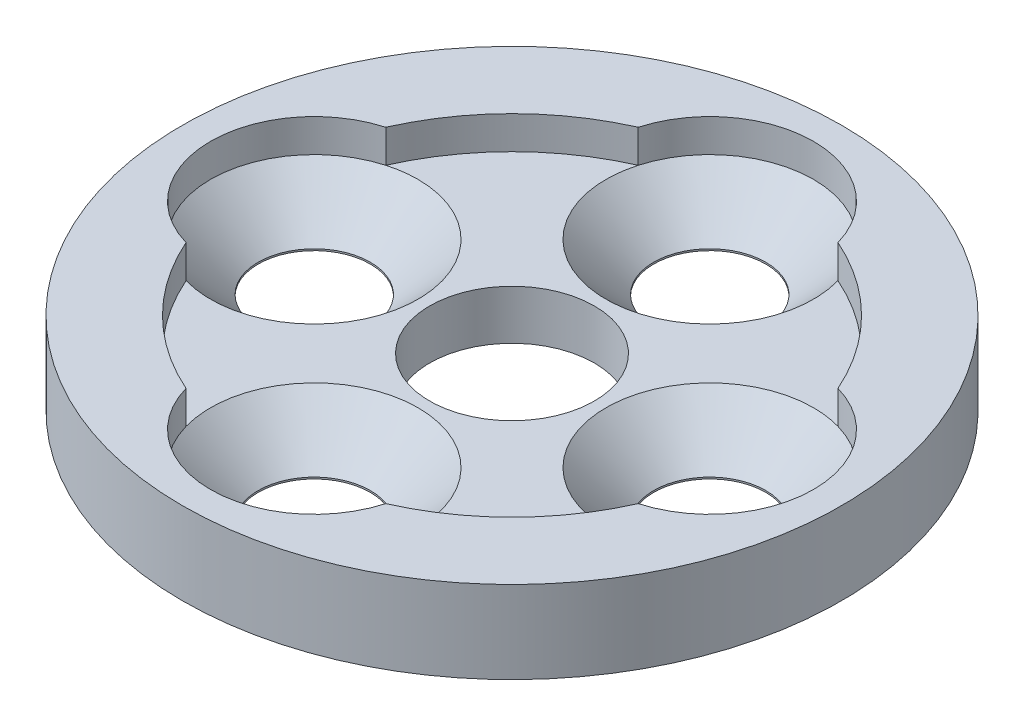
ISO-10303-21;
HEADER;
FILE_DESCRIPTION(('STEP AP214'),'2;1');
FILE_NAME('part.step','',(''),(''),'','','');
FILE_SCHEMA(('AUTOMOTIVE_DESIGN { 1 0 10303 214 1 1 1 1 }'));
ENDSEC;
DATA;
#1=APPLICATION_CONTEXT('core data for automotive mechanical design processes');
#2=APPLICATION_PROTOCOL_DEFINITION('international standard','automotive_design',2000,#1);
#3=PRODUCT_CONTEXT('',#1,'mechanical');
#4=PRODUCT('Part','Part','',(#3));
#5=PRODUCT_RELATED_PRODUCT_CATEGORY('part','',(#4));
#6=PRODUCT_DEFINITION_FORMATION('','',#4);
#7=PRODUCT_DEFINITION_CONTEXT('part definition',#1,'design');
#8=PRODUCT_DEFINITION('design','',#6,#7);
#9=PRODUCT_DEFINITION_SHAPE('','',#8);
#10=(LENGTH_UNIT() NAMED_UNIT(*) SI_UNIT(.MILLI.,.METRE.));
#11=(NAMED_UNIT(*) PLANE_ANGLE_UNIT() SI_UNIT($,.RADIAN.));
#12=(NAMED_UNIT(*) SI_UNIT($,.STERADIAN.) SOLID_ANGLE_UNIT());
#13=UNCERTAINTY_MEASURE_WITH_UNIT(LENGTH_MEASURE(1.E-05),#10,'distance_accuracy_value','');
#14=(GEOMETRIC_REPRESENTATION_CONTEXT(3) GLOBAL_UNCERTAINTY_ASSIGNED_CONTEXT((#13)) GLOBAL_UNIT_ASSIGNED_CONTEXT((#10,
#11,#12)) REPRESENTATION_CONTEXT('',''));
#15=CARTESIAN_POINT('',(0.,0.,0.));
#16=DIRECTION('',(0.,0.,1.));
#17=DIRECTION('',(1.,0.,0.));
#18=AXIS2_PLACEMENT_3D('',#15,#16,#17);
#19=CARTESIAN_POINT('',(0.,2.5,0.));
#20=DIRECTION('',(0.,-1.,0.));
#21=DIRECTION('',(0.,0.,1.));
#22=AXIS2_PLACEMENT_3D('',#19,#20,#21);
#23=CYLINDRICAL_SURFACE('',#22,7.5);
#24=CARTESIAN_POINT('',(0.,2.5,0.));
#25=DIRECTION('',(0.,-1.,0.));
#26=DIRECTION('',(0.,0.,-1.));
#27=AXIS2_PLACEMENT_3D('',#24,#25,#26);
#28=CIRCLE('',#27,7.5);
#29=CARTESIAN_POINT('',(-3.03015257196317,2.5,6.860625));
#30=VERTEX_POINT('',#29);
#31=CARTESIAN_POINT('',(-6.860625,2.5,3.03015257196317));
#32=VERTEX_POINT('',#31);
#33=EDGE_CURVE('E245',#30,#32,#28,.T.);
#34=ORIENTED_EDGE('',*,*,#33,.F.);
#35=DIRECTION('',(0.,-1.,0.));
#36=VECTOR('',#35,1.);
#37=CARTESIAN_POINT('',(-3.03015257196317,12.,6.860625));
#38=LINE('',#37,#36);
#39=CARTESIAN_POINT('',(-3.03015257196317,1.5,6.860625));
#40=VERTEX_POINT('',#39);
#41=EDGE_CURVE('E133',#40,#30,#38,.F.);
#42=ORIENTED_EDGE('',*,*,#41,.F.);
#43=CARTESIAN_POINT('',(0.,1.5,0.));
#44=DIRECTION('',(0.,-1.,0.));
#45=DIRECTION('',(0.,0.,-1.));
#46=AXIS2_PLACEMENT_3D('',#43,#44,#45);
#47=CIRCLE('',#46,7.5);
#48=CARTESIAN_POINT('',(-6.860625,1.5,3.03015257196317));
#49=VERTEX_POINT('',#48);
#50=EDGE_CURVE('E48',#49,#40,#47,.F.);
#51=ORIENTED_EDGE('',*,*,#50,.F.);
#52=DIRECTION('',(0.,-1.,0.));
#53=VECTOR('',#52,1.);
#54=CARTESIAN_POINT('',(-6.860625,12.,3.03015257196317));
#55=LINE('',#54,#53);
#56=EDGE_CURVE('E127',#32,#49,#55,.T.);
#57=ORIENTED_EDGE('',*,*,#56,.F.);
#58=EDGE_LOOP('',(#34,#42,#51,#57));
#59=FACE_BOUND('',#58,.T.);
#60=ADVANCED_FACE('F39',(#59),#23,.F.);
#61=CARTESIAN_POINT('',(-3.03015257196317,1.5,-6.860625));
#62=VERTEX_POINT('',#61);
#63=CARTESIAN_POINT('',(-6.860625,1.5,-3.03015257196317));
#64=VERTEX_POINT('',#63);
#65=EDGE_CURVE('E11',#62,#64,#47,.F.);
#66=ORIENTED_EDGE('',*,*,#65,.F.);
#67=DIRECTION('',(0.,-1.,0.));
#68=VECTOR('',#67,1.);
#69=CARTESIAN_POINT('',(-3.03015257196317,12.,-6.860625));
#70=LINE('',#69,#68);
#71=CARTESIAN_POINT('',(-3.03015257196317,2.5,-6.860625));
#72=VERTEX_POINT('',#71);
#73=EDGE_CURVE('E125',#72,#62,#70,.T.);
#74=ORIENTED_EDGE('',*,*,#73,.F.);
#75=CARTESIAN_POINT('',(-6.860625,2.5,-3.03015257196317));
#76=VERTEX_POINT('',#75);
#77=EDGE_CURVE('E148',#76,#72,#28,.T.);
#78=ORIENTED_EDGE('',*,*,#77,.F.);
#79=DIRECTION('',(0.,-1.,0.));
#80=VECTOR('',#79,1.);
#81=CARTESIAN_POINT('',(-6.860625,12.,-3.03015257196317));
#82=LINE('',#81,#80);
#83=EDGE_CURVE('E198',#64,#76,#82,.F.);
#84=ORIENTED_EDGE('',*,*,#83,.F.);
#85=EDGE_LOOP('',(#66,#74,#78,#84));
#86=FACE_BOUND('',#85,.T.);
#87=ADVANCED_FACE('F220',(#86),#23,.F.);
#88=CARTESIAN_POINT('',(6.860625,1.5,-3.03015257196317));
#89=VERTEX_POINT('',#88);
#90=CARTESIAN_POINT('',(3.03015257196317,1.5,-6.860625));
#91=VERTEX_POINT('',#90);
#92=EDGE_CURVE('E49',#89,#91,#47,.F.);
#93=ORIENTED_EDGE('',*,*,#92,.F.);
#94=DIRECTION('',(0.,-1.,0.));
#95=VECTOR('',#94,1.);
#96=CARTESIAN_POINT('',(6.860625,12.,-3.03015257196317));
#97=LINE('',#96,#95);
#98=CARTESIAN_POINT('',(6.860625,2.5,-3.03015257196317));
#99=VERTEX_POINT('',#98);
#100=EDGE_CURVE('E186',#99,#89,#97,.T.);
#101=ORIENTED_EDGE('',*,*,#100,.F.);
#102=CARTESIAN_POINT('',(3.03015257196317,2.5,-6.860625));
#103=VERTEX_POINT('',#102);
#104=EDGE_CURVE('E144',#103,#99,#28,.T.);
#105=ORIENTED_EDGE('',*,*,#104,.F.);
#106=DIRECTION('',(0.,-1.,0.));
#107=VECTOR('',#106,1.);
#108=CARTESIAN_POINT('',(3.03015257196317,12.,-6.860625));
#109=LINE('',#108,#107);
#110=EDGE_CURVE('E183',#91,#103,#109,.F.);
#111=ORIENTED_EDGE('',*,*,#110,.F.);
#112=EDGE_LOOP('',(#93,#101,#105,#111));
#113=FACE_BOUND('',#112,.T.);
#114=ADVANCED_FACE('F226',(#113),#23,.F.);
#115=CARTESIAN_POINT('',(6.860625,2.5,3.03015257196317));
#116=VERTEX_POINT('',#115);
#117=CARTESIAN_POINT('',(3.03015257196317,2.5,6.860625));
#118=VERTEX_POINT('',#117);
#119=EDGE_CURVE('E147',#116,#118,#28,.T.);
#120=ORIENTED_EDGE('',*,*,#119,.F.);
#121=DIRECTION('',(0.,-1.,0.));
#122=VECTOR('',#121,1.);
#123=CARTESIAN_POINT('',(6.860625,12.,3.03015257196317));
#124=LINE('',#123,#122);
#125=CARTESIAN_POINT('',(6.860625,1.5,3.03015257196317));
#126=VERTEX_POINT('',#125);
#127=EDGE_CURVE('E190',#126,#116,#124,.F.);
#128=ORIENTED_EDGE('',*,*,#127,.F.);
#129=CARTESIAN_POINT('',(3.03015257196317,1.5,6.860625));
#130=VERTEX_POINT('',#129);
#131=EDGE_CURVE('E135',#130,#126,#47,.F.);
#132=ORIENTED_EDGE('',*,*,#131,.F.);
#133=DIRECTION('',(0.,-1.,0.));
#134=VECTOR('',#133,1.);
#135=CARTESIAN_POINT('',(3.03015257196317,12.,6.860625));
#136=LINE('',#135,#134);
#137=EDGE_CURVE('E192',#118,#130,#136,.T.);
#138=ORIENTED_EDGE('',*,*,#137,.F.);
#139=EDGE_LOOP('',(#120,#128,#132,#138));
#140=FACE_BOUND('',#139,.T.);
#141=ADVANCED_FACE('F222',(#140),#23,.F.);
#142=CARTESIAN_POINT('',(0.,1.5,0.));
#143=DIRECTION('',(0.,-1.,0.));
#144=DIRECTION('',(0.,0.,1.));
#145=AXIS2_PLACEMENT_3D('',#142,#143,#144);
#146=CYLINDRICAL_SURFACE('',#145,10.);
#147=CARTESIAN_POINT('',(0.,0.,0.));
#148=DIRECTION('',(0.,-1.,0.));
#149=DIRECTION('',(0.,0.,-1.));
#150=AXIS2_PLACEMENT_3D('',#147,#148,#149);
#151=CIRCLE('',#150,10.);
#152=CARTESIAN_POINT('',(0.,0.,-10.));
#153=VERTEX_POINT('',#152);
#154=EDGE_CURVE('E138',#153,#153,#151,.T.);
#155=ORIENTED_EDGE('',*,*,#154,.F.);
#156=EDGE_LOOP('',(#155));
#157=FACE_BOUND('',#156,.T.);
#158=CARTESIAN_POINT('',(0.,2.5,0.));
#159=DIRECTION('',(0.,-1.,0.));
#160=DIRECTION('',(0.,0.,-1.));
#161=AXIS2_PLACEMENT_3D('',#158,#159,#160);
#162=CIRCLE('',#161,10.);
#163=CARTESIAN_POINT('',(0.,2.5,-10.));
#164=VERTEX_POINT('',#163);
#165=EDGE_CURVE('E141',#164,#164,#162,.T.);
#166=ORIENTED_EDGE('',*,*,#165,.T.);
#167=EDGE_LOOP('',(#166));
#168=FACE_BOUND('',#167,.T.);
#169=ADVANCED_FACE('F41',(#157,#168),#146,.T.);
#170=CARTESIAN_POINT('',(0.,0.,0.));
#171=DIRECTION('',(0.,1.,0.));
#172=DIRECTION('',(0.,0.,-1.));
#173=AXIS2_PLACEMENT_3D('',#170,#171,#172);
#174=PLANE('',#173);
#175=CARTESIAN_POINT('',(0.,0.,0.));
#176=DIRECTION('',(0.,-1.,0.));
#177=DIRECTION('',(0.,0.,-1.));
#178=AXIS2_PLACEMENT_3D('',#175,#176,#177);
#179=CIRCLE('',#178,2.5);
#180=CARTESIAN_POINT('',(0.,0.,-2.5));
#181=VERTEX_POINT('',#180);
#182=EDGE_CURVE('E200',#181,#181,#179,.T.);
#183=ORIENTED_EDGE('',*,*,#182,.F.);
#184=EDGE_LOOP('',(#183));
#185=FACE_BOUND('',#184,.T.);
#186=CARTESIAN_POINT('',(-6.,0.,0.));
#187=DIRECTION('',(0.,-1.,0.));
#188=DIRECTION('',(0.,0.,-1.));
#189=AXIS2_PLACEMENT_3D('',#186,#187,#188);
#190=CIRCLE('',#189,1.7);
#191=CARTESIAN_POINT('',(-6.,0.,-1.7));
#192=VERTEX_POINT('',#191);
#193=EDGE_CURVE('E174',#192,#192,#190,.T.);
#194=ORIENTED_EDGE('',*,*,#193,.F.);
#195=EDGE_LOOP('',(#194));
#196=FACE_BOUND('',#195,.T.);
#197=CARTESIAN_POINT('',(0.,0.,6.));
#198=DIRECTION('',(0.,-1.,0.));
#199=DIRECTION('',(0.,0.,-1.));
#200=AXIS2_PLACEMENT_3D('',#197,#198,#199);
#201=CIRCLE('',#200,1.7);
#202=CARTESIAN_POINT('',(0.,0.,4.3));
#203=VERTEX_POINT('',#202);
#204=EDGE_CURVE('E166',#203,#203,#201,.T.);
#205=ORIENTED_EDGE('',*,*,#204,.F.);
#206=EDGE_LOOP('',(#205));
#207=FACE_BOUND('',#206,.T.);
#208=CARTESIAN_POINT('',(6.,0.,0.));
#209=DIRECTION('',(0.,-1.,0.));
#210=DIRECTION('',(0.,0.,-1.));
#211=AXIS2_PLACEMENT_3D('',#208,#209,#210);
#212=CIRCLE('',#211,1.7);
#213=CARTESIAN_POINT('',(6.,0.,-1.7));
#214=VERTEX_POINT('',#213);
#215=EDGE_CURVE('E158',#214,#214,#212,.T.);
#216=ORIENTED_EDGE('',*,*,#215,.F.);
#217=EDGE_LOOP('',(#216));
#218=FACE_BOUND('',#217,.T.);
#219=CARTESIAN_POINT('',(0.,0.,-6.));
#220=DIRECTION('',(0.,-1.,0.));
#221=DIRECTION('',(0.,0.,-1.));
#222=AXIS2_PLACEMENT_3D('',#219,#220,#221);
#223=CIRCLE('',#222,1.7);
#224=CARTESIAN_POINT('',(0.,0.,-7.7));
#225=VERTEX_POINT('',#224);
#226=EDGE_CURVE('E149',#225,#225,#223,.T.);
#227=ORIENTED_EDGE('',*,*,#226,.F.);
#228=EDGE_LOOP('',(#227));
#229=FACE_BOUND('',#228,.T.);
#230=ORIENTED_EDGE('',*,*,#154,.T.);
#231=EDGE_LOOP('',(#230));
#232=FACE_BOUND('',#231,.T.);
#233=ADVANCED_FACE('F236',(#185,#196,#207,#218,#229,#232),#174,.F.);
#234=CARTESIAN_POINT('',(0.,2.5,0.));
#235=DIRECTION('',(0.,1.,0.));
#236=DIRECTION('',(0.,0.,-1.));
#237=AXIS2_PLACEMENT_3D('',#234,#235,#236);
#238=PLANE('',#237);
#239=ORIENTED_EDGE('',*,*,#165,.F.);
#240=EDGE_LOOP('',(#239));
#241=FACE_BOUND('',#240,.T.);
#242=ORIENTED_EDGE('',*,*,#77,.T.);
#243=CARTESIAN_POINT('',(0.,2.5,-6.));
#244=DIRECTION('',(0.,-1.,0.));
#245=DIRECTION('',(0.,0.,-1.));
#246=AXIS2_PLACEMENT_3D('',#243,#244,#245);
#247=CIRCLE('',#246,3.15);
#248=EDGE_CURVE('E181',#103,#72,#247,.F.);
#249=ORIENTED_EDGE('',*,*,#248,.F.);
#250=ORIENTED_EDGE('',*,*,#104,.T.);
#251=CARTESIAN_POINT('',(6.,2.5,0.));
#252=DIRECTION('',(0.,-1.,0.));
#253=DIRECTION('',(0.,0.,-1.));
#254=AXIS2_PLACEMENT_3D('',#251,#252,#253);
#255=CIRCLE('',#254,3.15);
#256=EDGE_CURVE('E188',#116,#99,#255,.F.);
#257=ORIENTED_EDGE('',*,*,#256,.F.);
#258=ORIENTED_EDGE('',*,*,#119,.T.);
#259=CARTESIAN_POINT('',(0.,2.5,6.));
#260=DIRECTION('',(0.,-1.,0.));
#261=DIRECTION('',(0.,0.,-1.));
#262=AXIS2_PLACEMENT_3D('',#259,#260,#261);
#263=CIRCLE('',#262,3.15);
#264=EDGE_CURVE('E194',#30,#118,#263,.F.);
#265=ORIENTED_EDGE('',*,*,#264,.F.);
#266=ORIENTED_EDGE('',*,*,#33,.T.);
#267=CARTESIAN_POINT('',(-6.,2.5,0.));
#268=DIRECTION('',(0.,-1.,0.));
#269=DIRECTION('',(0.,0.,-1.));
#270=AXIS2_PLACEMENT_3D('',#267,#268,#269);
#271=CIRCLE('',#270,3.15);
#272=EDGE_CURVE('E129',#76,#32,#271,.F.);
#273=ORIENTED_EDGE('',*,*,#272,.F.);
#274=EDGE_LOOP('',(#242,#249,#250,#257,#258,#265,#266,#273));
#275=FACE_BOUND('',#274,.T.);
#276=ADVANCED_FACE('F249',(#241,#275),#238,.T.);
#277=CARTESIAN_POINT('',(0.,1.5,0.));
#278=DIRECTION('',(0.,1.,0.));
#279=DIRECTION('',(0.,0.,-1.));
#280=AXIS2_PLACEMENT_3D('',#277,#278,#279);
#281=PLANE('',#280);
#282=CARTESIAN_POINT('',(0.,1.5,0.));
#283=DIRECTION('',(0.,-1.,0.));
#284=DIRECTION('',(0.,0.,-1.));
#285=AXIS2_PLACEMENT_3D('',#282,#283,#284);
#286=CIRCLE('',#285,2.5);
#287=CARTESIAN_POINT('',(0.,1.5,-2.5));
#288=VERTEX_POINT('',#287);
#289=EDGE_CURVE('E43',#288,#288,#286,.T.);
#290=ORIENTED_EDGE('',*,*,#289,.T.);
#291=EDGE_LOOP('',(#290));
#292=FACE_BOUND('',#291,.T.);
#293=CARTESIAN_POINT('',(-6.,1.5,0.));
#294=DIRECTION('',(0.,-1.,0.));
#295=DIRECTION('',(0.,0.,-1.));
#296=AXIS2_PLACEMENT_3D('',#293,#294,#295);
#297=CIRCLE('',#296,3.15);
#298=EDGE_CURVE('E110',#64,#49,#297,.T.);
#299=ORIENTED_EDGE('',*,*,#298,.T.);
#300=ORIENTED_EDGE('',*,*,#50,.T.);
#301=CARTESIAN_POINT('',(0.,1.5,6.));
#302=DIRECTION('',(0.,-1.,0.));
#303=DIRECTION('',(0.,0.,-1.));
#304=AXIS2_PLACEMENT_3D('',#301,#302,#303);
#305=CIRCLE('',#304,3.15);
#306=EDGE_CURVE('E173',#40,#130,#305,.T.);
#307=ORIENTED_EDGE('',*,*,#306,.T.);
#308=ORIENTED_EDGE('',*,*,#131,.T.);
#309=CARTESIAN_POINT('',(6.,1.5,0.));
#310=DIRECTION('',(0.,-1.,0.));
#311=DIRECTION('',(0.,0.,-1.));
#312=AXIS2_PLACEMENT_3D('',#309,#310,#311);
#313=CIRCLE('',#312,3.15);
#314=EDGE_CURVE('E165',#126,#89,#313,.T.);
#315=ORIENTED_EDGE('',*,*,#314,.T.);
#316=ORIENTED_EDGE('',*,*,#92,.T.);
#317=CARTESIAN_POINT('',(0.,1.5,-6.));
#318=DIRECTION('',(0.,-1.,0.));
#319=DIRECTION('',(0.,0.,-1.));
#320=AXIS2_PLACEMENT_3D('',#317,#318,#319);
#321=CIRCLE('',#320,3.15);
#322=EDGE_CURVE('E155',#91,#62,#321,.T.);
#323=ORIENTED_EDGE('',*,*,#322,.T.);
#324=ORIENTED_EDGE('',*,*,#65,.T.);
#325=EDGE_LOOP('',(#299,#300,#307,#308,#315,#316,#323,#324));
#326=FACE_BOUND('',#325,.T.);
#327=ADVANCED_FACE('F119',(#292,#326),#281,.T.);
#328=CARTESIAN_POINT('',(0.,1.5,-6.));
#329=DIRECTION('',(0.,1.,0.));
#330=DIRECTION('',(0.,0.,-1.));
#331=AXIS2_PLACEMENT_3D('',#328,#329,#330);
#332=CYLINDRICAL_SURFACE('',#331,1.7);
#333=ORIENTED_EDGE('',*,*,#226,.T.);
#334=EDGE_LOOP('',(#333));
#335=FACE_BOUND('',#334,.T.);
#336=CARTESIAN_POINT('',(0.,0.0499999999999932,-6.));
#337=DIRECTION('',(0.,-1.,0.));
#338=DIRECTION('',(0.,0.,-1.));
#339=AXIS2_PLACEMENT_3D('',#336,#337,#338);
#340=CIRCLE('',#339,1.7);
#341=CARTESIAN_POINT('',(0.,0.0499999999999932,-7.7));
#342=VERTEX_POINT('',#341);
#343=EDGE_CURVE('E152',#342,#342,#340,.T.);
#344=ORIENTED_EDGE('',*,*,#343,.F.);
#345=EDGE_LOOP('',(#344));
#346=FACE_BOUND('',#345,.T.);
#347=ADVANCED_FACE('F289',(#335,#346),#332,.F.);
#348=CARTESIAN_POINT('',(0.,1.5,-6.));
#349=DIRECTION('',(0.,1.,0.));
#350=DIRECTION('',(0.,0.,-1.));
#351=AXIS2_PLACEMENT_3D('',#348,#349,#350);
#352=CONICAL_SURFACE('',#351,3.15,0.785398163397447);
#353=ORIENTED_EDGE('',*,*,#343,.T.);
#354=EDGE_LOOP('',(#353));
#355=FACE_BOUND('',#354,.T.);
#356=ORIENTED_EDGE('',*,*,#322,.F.);
#357=EDGE_CURVE('E157',#62,#91,#321,.T.);
#358=ORIENTED_EDGE('',*,*,#357,.F.);
#359=EDGE_LOOP('',(#356,#358));
#360=FACE_BOUND('',#359,.T.);
#361=ADVANCED_FACE('F286',(#355,#360),#352,.F.);
#362=CARTESIAN_POINT('',(6.,1.5,0.));
#363=DIRECTION('',(0.,1.,0.));
#364=DIRECTION('',(0.,0.,-1.));
#365=AXIS2_PLACEMENT_3D('',#362,#363,#364);
#366=CYLINDRICAL_SURFACE('',#365,1.7);
#367=ORIENTED_EDGE('',*,*,#215,.T.);
#368=EDGE_LOOP('',(#367));
#369=FACE_BOUND('',#368,.T.);
#370=CARTESIAN_POINT('',(6.,0.0499999999999932,0.));
#371=DIRECTION('',(0.,-1.,0.));
#372=DIRECTION('',(0.,0.,-1.));
#373=AXIS2_PLACEMENT_3D('',#370,#371,#372);
#374=CIRCLE('',#373,1.7);
#375=CARTESIAN_POINT('',(6.,0.0499999999999932,-1.7));
#376=VERTEX_POINT('',#375);
#377=EDGE_CURVE('E161',#376,#376,#374,.T.);
#378=ORIENTED_EDGE('',*,*,#377,.F.);
#379=EDGE_LOOP('',(#378));
#380=FACE_BOUND('',#379,.T.);
#381=ADVANCED_FACE('F282',(#369,#380),#366,.F.);
#382=CARTESIAN_POINT('',(6.,1.5,0.));
#383=DIRECTION('',(0.,1.,0.));
#384=DIRECTION('',(0.,0.,-1.));
#385=AXIS2_PLACEMENT_3D('',#382,#383,#384);
#386=CONICAL_SURFACE('',#385,3.15,0.785398163397447);
#387=ORIENTED_EDGE('',*,*,#377,.T.);
#388=EDGE_LOOP('',(#387));
#389=FACE_BOUND('',#388,.T.);
#390=EDGE_CURVE('E64',#89,#126,#313,.T.);
#391=ORIENTED_EDGE('',*,*,#390,.F.);
#392=ORIENTED_EDGE('',*,*,#314,.F.);
#393=EDGE_LOOP('',(#391,#392));
#394=FACE_BOUND('',#393,.T.);
#395=ADVANCED_FACE('F278',(#389,#394),#386,.F.);
#396=CARTESIAN_POINT('',(0.,1.5,6.));
#397=DIRECTION('',(0.,1.,0.));
#398=DIRECTION('',(0.,0.,-1.));
#399=AXIS2_PLACEMENT_3D('',#396,#397,#398);
#400=CYLINDRICAL_SURFACE('',#399,1.7);
#401=ORIENTED_EDGE('',*,*,#204,.T.);
#402=EDGE_LOOP('',(#401));
#403=FACE_BOUND('',#402,.T.);
#404=CARTESIAN_POINT('',(0.,0.0499999999999932,6.));
#405=DIRECTION('',(0.,-1.,0.));
#406=DIRECTION('',(0.,0.,-1.));
#407=AXIS2_PLACEMENT_3D('',#404,#405,#406);
#408=CIRCLE('',#407,1.7);
#409=CARTESIAN_POINT('',(0.,0.0499999999999932,4.30000000000001));
#410=VERTEX_POINT('',#409);
#411=EDGE_CURVE('E169',#410,#410,#408,.T.);
#412=ORIENTED_EDGE('',*,*,#411,.F.);
#413=EDGE_LOOP('',(#412));
#414=FACE_BOUND('',#413,.T.);
#415=ADVANCED_FACE('F274',(#403,#414),#400,.F.);
#416=CARTESIAN_POINT('',(0.,1.5,6.));
#417=DIRECTION('',(0.,1.,0.));
#418=DIRECTION('',(0.,0.,-1.));
#419=AXIS2_PLACEMENT_3D('',#416,#417,#418);
#420=CONICAL_SURFACE('',#419,3.15,0.785398163397447);
#421=ORIENTED_EDGE('',*,*,#411,.T.);
#422=EDGE_LOOP('',(#421));
#423=FACE_BOUND('',#422,.T.);
#424=EDGE_CURVE('E56',#130,#40,#305,.T.);
#425=ORIENTED_EDGE('',*,*,#424,.F.);
#426=ORIENTED_EDGE('',*,*,#306,.F.);
#427=EDGE_LOOP('',(#425,#426));
#428=FACE_BOUND('',#427,.T.);
#429=ADVANCED_FACE('F270',(#423,#428),#420,.F.);
#430=CARTESIAN_POINT('',(-6.,1.5,0.));
#431=DIRECTION('',(0.,1.,0.));
#432=DIRECTION('',(0.,0.,-1.));
#433=AXIS2_PLACEMENT_3D('',#430,#431,#432);
#434=CYLINDRICAL_SURFACE('',#433,1.7);
#435=ORIENTED_EDGE('',*,*,#193,.T.);
#436=EDGE_LOOP('',(#435));
#437=FACE_BOUND('',#436,.T.);
#438=CARTESIAN_POINT('',(-6.,0.0499999999999932,0.));
#439=DIRECTION('',(0.,-1.,0.));
#440=DIRECTION('',(0.,0.,-1.));
#441=AXIS2_PLACEMENT_3D('',#438,#439,#440);
#442=CIRCLE('',#441,1.7);
#443=CARTESIAN_POINT('',(-6.,0.0499999999999932,-1.7));
#444=VERTEX_POINT('',#443);
#445=EDGE_CURVE('E115',#444,#444,#442,.T.);
#446=ORIENTED_EDGE('',*,*,#445,.F.);
#447=EDGE_LOOP('',(#446));
#448=FACE_BOUND('',#447,.T.);
#449=ADVANCED_FACE('F266',(#437,#448),#434,.F.);
#450=CARTESIAN_POINT('',(-6.,1.5,0.));
#451=DIRECTION('',(0.,1.,0.));
#452=DIRECTION('',(0.,0.,-1.));
#453=AXIS2_PLACEMENT_3D('',#450,#451,#452);
#454=CONICAL_SURFACE('',#453,3.15,0.785398163397447);
#455=ORIENTED_EDGE('',*,*,#445,.T.);
#456=EDGE_LOOP('',(#455));
#457=FACE_BOUND('',#456,.T.);
#458=EDGE_CURVE('E107',#49,#64,#297,.T.);
#459=ORIENTED_EDGE('',*,*,#458,.F.);
#460=ORIENTED_EDGE('',*,*,#298,.F.);
#461=EDGE_LOOP('',(#459,#460));
#462=FACE_BOUND('',#461,.T.);
#463=ADVANCED_FACE('F109',(#457,#462),#454,.F.);
#464=CARTESIAN_POINT('',(-6.,22.5,0.));
#465=DIRECTION('',(0.,-1.,0.));
#466=DIRECTION('',(0.,0.,1.));
#467=AXIS2_PLACEMENT_3D('',#464,#465,#466);
#468=CYLINDRICAL_SURFACE('',#467,3.15);
#469=ORIENTED_EDGE('',*,*,#272,.T.);
#470=ORIENTED_EDGE('',*,*,#56,.T.);
#471=ORIENTED_EDGE('',*,*,#458,.T.);
#472=ORIENTED_EDGE('',*,*,#83,.T.);
#473=EDGE_LOOP('',(#469,#470,#471,#472));
#474=FACE_BOUND('',#473,.T.);
#475=ADVANCED_FACE('F128',(#474),#468,.F.);
#476=CARTESIAN_POINT('',(0.,22.5,6.));
#477=DIRECTION('',(0.,-1.,0.));
#478=DIRECTION('',(0.,0.,1.));
#479=AXIS2_PLACEMENT_3D('',#476,#477,#478);
#480=CYLINDRICAL_SURFACE('',#479,3.15);
#481=ORIENTED_EDGE('',*,*,#264,.T.);
#482=ORIENTED_EDGE('',*,*,#137,.T.);
#483=ORIENTED_EDGE('',*,*,#424,.T.);
#484=ORIENTED_EDGE('',*,*,#41,.T.);
#485=EDGE_LOOP('',(#481,#482,#483,#484));
#486=FACE_BOUND('',#485,.T.);
#487=ADVANCED_FACE('F257',(#486),#480,.F.);
#488=CARTESIAN_POINT('',(6.,22.5,0.));
#489=DIRECTION('',(0.,-1.,0.));
#490=DIRECTION('',(0.,0.,1.));
#491=AXIS2_PLACEMENT_3D('',#488,#489,#490);
#492=CYLINDRICAL_SURFACE('',#491,3.15);
#493=ORIENTED_EDGE('',*,*,#256,.T.);
#494=ORIENTED_EDGE('',*,*,#100,.T.);
#495=ORIENTED_EDGE('',*,*,#390,.T.);
#496=ORIENTED_EDGE('',*,*,#127,.T.);
#497=EDGE_LOOP('',(#493,#494,#495,#496));
#498=FACE_BOUND('',#497,.T.);
#499=ADVANCED_FACE('F215',(#498),#492,.F.);
#500=CARTESIAN_POINT('',(0.,22.5,-6.));
#501=DIRECTION('',(0.,-1.,0.));
#502=DIRECTION('',(0.,0.,1.));
#503=AXIS2_PLACEMENT_3D('',#500,#501,#502);
#504=CYLINDRICAL_SURFACE('',#503,3.15);
#505=ORIENTED_EDGE('',*,*,#248,.T.);
#506=ORIENTED_EDGE('',*,*,#73,.T.);
#507=ORIENTED_EDGE('',*,*,#357,.T.);
#508=ORIENTED_EDGE('',*,*,#110,.T.);
#509=EDGE_LOOP('',(#505,#506,#507,#508));
#510=FACE_BOUND('',#509,.T.);
#511=ADVANCED_FACE('F210',(#510),#504,.F.);
#512=CARTESIAN_POINT('',(0.,0.,0.));
#513=DIRECTION('',(0.,1.,0.));
#514=DIRECTION('',(0.,0.,-1.));
#515=AXIS2_PLACEMENT_3D('',#512,#513,#514);
#516=CYLINDRICAL_SURFACE('',#515,2.5);
#517=ORIENTED_EDGE('',*,*,#289,.F.);
#518=EDGE_LOOP('',(#517));
#519=FACE_BOUND('',#518,.T.);
#520=ORIENTED_EDGE('',*,*,#182,.T.);
#521=EDGE_LOOP('',(#520));
#522=FACE_BOUND('',#521,.T.);
#523=ADVANCED_FACE('F208',(#519,#522),#516,.F.);
#524=CLOSED_SHELL('',(#60,#87,#114,#141,#169,#233,#276,#327,#347,#361,#381,#395,#415,#429,#449,
#463,#475,#487,#499,#511,#523));
#525=MANIFOLD_SOLID_BREP('B2',#524);
#526=ADVANCED_BREP_SHAPE_REPRESENTATION('',(#18,#525),#14);
#527=SHAPE_DEFINITION_REPRESENTATION(#9,#526);
ENDSEC;
END-ISO-10303-21;
